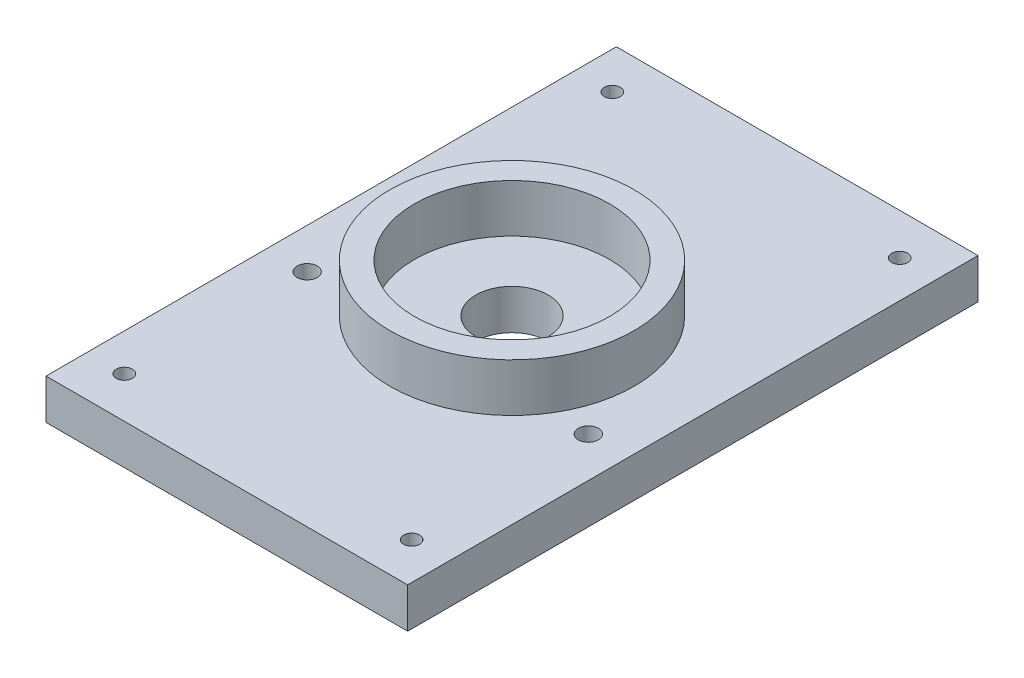
ISO-10303-21;
HEADER;
FILE_DESCRIPTION(('STEP AP214'),'2;1');
FILE_NAME('part.step','',(''),(''),'','','');
FILE_SCHEMA(('AUTOMOTIVE_DESIGN { 1 0 10303 214 1 1 1 1 }'));
ENDSEC;
DATA;
#1=APPLICATION_CONTEXT('core data for automotive mechanical design processes');
#2=APPLICATION_PROTOCOL_DEFINITION('international standard','automotive_design',2000,#1);
#3=PRODUCT_CONTEXT('',#1,'mechanical');
#4=PRODUCT('Part','Part','',(#3));
#5=PRODUCT_RELATED_PRODUCT_CATEGORY('part','',(#4));
#6=PRODUCT_DEFINITION_FORMATION('','',#4);
#7=PRODUCT_DEFINITION_CONTEXT('part definition',#1,'design');
#8=PRODUCT_DEFINITION('design','',#6,#7);
#9=PRODUCT_DEFINITION_SHAPE('','',#8);
#10=(LENGTH_UNIT() NAMED_UNIT(*) SI_UNIT(.MILLI.,.METRE.));
#11=(NAMED_UNIT(*) PLANE_ANGLE_UNIT() SI_UNIT($,.RADIAN.));
#12=(NAMED_UNIT(*) SI_UNIT($,.STERADIAN.) SOLID_ANGLE_UNIT());
#13=UNCERTAINTY_MEASURE_WITH_UNIT(LENGTH_MEASURE(1.E-05),#10,'distance_accuracy_value','');
#14=(GEOMETRIC_REPRESENTATION_CONTEXT(3) GLOBAL_UNCERTAINTY_ASSIGNED_CONTEXT((#13)) GLOBAL_UNIT_ASSIGNED_CONTEXT((#10,
#11,#12)) REPRESENTATION_CONTEXT('',''));
#15=CARTESIAN_POINT('',(0.,0.,0.));
#16=DIRECTION('',(0.,0.,1.));
#17=DIRECTION('',(1.,0.,0.));
#18=AXIS2_PLACEMENT_3D('',#15,#16,#17);
#19=CARTESIAN_POINT('',(0.,5.,0.));
#20=DIRECTION('',(0.,1.,0.));
#21=DIRECTION('',(0.,0.,1.));
#22=AXIS2_PLACEMENT_3D('',#19,#20,#21);
#23=PLANE('',#22);
#24=CARTESIAN_POINT('',(0.136395342844091,5.,-0.409186028532307));
#25=DIRECTION('',(0.,1.,0.));
#26=DIRECTION('',(0.,0.,1.));
#27=AXIS2_PLACEMENT_3D('',#24,#25,#26);
#28=CIRCLE('',#27,4.5);
#29=CARTESIAN_POINT('',(0.136395342844091,5.,4.09081397146769));
#30=VERTEX_POINT('',#29);
#31=EDGE_CURVE('E114',#30,#30,#28,.T.);
#32=ORIENTED_EDGE('',*,*,#31,.F.);
#33=EDGE_LOOP('',(#32));
#34=FACE_BOUND('',#33,.T.);
#35=CARTESIAN_POINT('',(0.136395342844091,5.,-0.409186028532307));
#36=DIRECTION('',(0.,1.,0.));
#37=DIRECTION('',(0.,0.,1.));
#38=AXIS2_PLACEMENT_3D('',#35,#36,#37);
#39=CIRCLE('',#38,12.15);
#40=CARTESIAN_POINT('',(0.136395342844091,5.,11.7408139714677));
#41=VERTEX_POINT('',#40);
#42=EDGE_CURVE('E135',#41,#41,#39,.F.);
#43=ORIENTED_EDGE('',*,*,#42,.F.);
#44=EDGE_LOOP('',(#43));
#45=FACE_BOUND('',#44,.T.);
#46=ADVANCED_FACE('F46',(#34,#45),#23,.T.);
#47=CARTESIAN_POINT('',(0.136395342844091,5.,-0.409186028532307));
#48=DIRECTION('',(0.,1.,0.));
#49=DIRECTION('',(0.,0.,1.));
#50=AXIS2_PLACEMENT_3D('',#47,#48,#49);
#51=CIRCLE('',#50,15.2);
#52=CARTESIAN_POINT('',(0.136395342844091,5.,14.7908139714677));
#53=VERTEX_POINT('',#52);
#54=EDGE_CURVE('E132',#53,#53,#51,.T.);
#55=ORIENTED_EDGE('',*,*,#54,.F.);
#56=EDGE_LOOP('',(#55));
#57=FACE_BOUND('',#56,.T.);
#58=DIRECTION('',(0.,0.,1.));
#59=VECTOR('',#58,1.);
#60=CARTESIAN_POINT('',(-22.3714650620397,5.,-35.9091860285323));
#61=LINE('',#60,#59);
#62=CARTESIAN_POINT('',(-22.3714650620397,5.,-35.9091860285323));
#63=VERTEX_POINT('',#62);
#64=CARTESIAN_POINT('',(-22.3714650620397,5.,35.0908139714677));
#65=VERTEX_POINT('',#64);
#66=EDGE_CURVE('E99',#63,#65,#61,.T.);
#67=ORIENTED_EDGE('',*,*,#66,.T.);
#68=DIRECTION('',(1.,0.,0.));
#69=VECTOR('',#68,1.);
#70=CARTESIAN_POINT('',(-22.3714650620397,5.,35.0908139714677));
#71=LINE('',#70,#69);
#72=CARTESIAN_POINT('',(22.6442557477279,5.,35.0908139714677));
#73=VERTEX_POINT('',#72);
#74=EDGE_CURVE('E93',#65,#73,#71,.T.);
#75=ORIENTED_EDGE('',*,*,#74,.T.);
#76=DIRECTION('',(0.,0.,-1.));
#77=VECTOR('',#76,1.);
#78=CARTESIAN_POINT('',(22.6442557477279,5.,35.0908139714677));
#79=LINE('',#78,#77);
#80=CARTESIAN_POINT('',(22.6442557477279,5.,-35.9091860285323));
#81=VERTEX_POINT('',#80);
#82=EDGE_CURVE('E97',#73,#81,#79,.T.);
#83=ORIENTED_EDGE('',*,*,#82,.T.);
#84=DIRECTION('',(-1.,0.,0.));
#85=VECTOR('',#84,1.);
#86=CARTESIAN_POINT('',(22.6442557477279,5.,-35.9091860285323));
#87=LINE('',#86,#85);
#88=EDGE_CURVE('E63',#81,#63,#87,.T.);
#89=ORIENTED_EDGE('',*,*,#88,.T.);
#90=EDGE_LOOP('',(#67,#75,#83,#89));
#91=FACE_BOUND('',#90,.T.);
#92=CARTESIAN_POINT('',(-17.7501447184801,5.,29.9694936279081));
#93=DIRECTION('',(0.,1.,0.));
#94=DIRECTION('',(0.,0.,1.));
#95=AXIS2_PLACEMENT_3D('',#92,#93,#94);
#96=CIRCLE('',#95,0.999999999999994);
#97=CARTESIAN_POINT('',(-17.7501447184801,5.,30.9694936279081));
#98=VERTEX_POINT('',#97);
#99=EDGE_CURVE('E146',#98,#98,#96,.T.);
#100=ORIENTED_EDGE('',*,*,#99,.F.);
#101=EDGE_LOOP('',(#100));
#102=FACE_BOUND('',#101,.T.);
#103=CARTESIAN_POINT('',(18.0229354041683,5.,29.9694936279081));
#104=DIRECTION('',(0.,1.,0.));
#105=DIRECTION('',(0.,0.,1.));
#106=AXIS2_PLACEMENT_3D('',#103,#104,#105);
#107=CIRCLE('',#106,0.999999999999994);
#108=CARTESIAN_POINT('',(18.0229354041683,5.,30.9694936279081));
#109=VERTEX_POINT('',#108);
#110=EDGE_CURVE('E152',#109,#109,#107,.T.);
#111=ORIENTED_EDGE('',*,*,#110,.F.);
#112=EDGE_LOOP('',(#111));
#113=FACE_BOUND('',#112,.T.);
#114=CARTESIAN_POINT('',(17.6363953428441,5.,7.59081397145539));
#115=DIRECTION('',(0.,1.,0.));
#116=DIRECTION('',(0.,0.,1.));
#117=AXIS2_PLACEMENT_3D('',#114,#115,#116);
#118=CIRCLE('',#117,1.25);
#119=CARTESIAN_POINT('',(17.6363953428441,5.,8.84081397145539));
#120=VERTEX_POINT('',#119);
#121=EDGE_CURVE('E158',#120,#120,#118,.T.);
#122=ORIENTED_EDGE('',*,*,#121,.F.);
#123=EDGE_LOOP('',(#122));
#124=FACE_BOUND('',#123,.T.);
#125=CARTESIAN_POINT('',(-17.3636046571559,5.,7.59081397145539));
#126=DIRECTION('',(0.,1.,0.));
#127=DIRECTION('',(0.,0.,1.));
#128=AXIS2_PLACEMENT_3D('',#125,#126,#127);
#129=CIRCLE('',#128,1.25);
#130=CARTESIAN_POINT('',(-17.3636046571559,5.,8.8408139714554));
#131=VERTEX_POINT('',#130);
#132=EDGE_CURVE('E164',#131,#131,#129,.T.);
#133=ORIENTED_EDGE('',*,*,#132,.F.);
#134=EDGE_LOOP('',(#133));
#135=FACE_BOUND('',#134,.T.);
#136=CARTESIAN_POINT('',(-17.7501447184801,5.,-30.7878656849727));
#137=DIRECTION('',(0.,1.,0.));
#138=DIRECTION('',(0.,0.,1.));
#139=AXIS2_PLACEMENT_3D('',#136,#137,#138);
#140=CIRCLE('',#139,0.999999999999998);
#141=CARTESIAN_POINT('',(-17.7501447184801,5.,-29.7878656849727));
#142=VERTEX_POINT('',#141);
#143=EDGE_CURVE('E170',#142,#142,#140,.T.);
#144=ORIENTED_EDGE('',*,*,#143,.F.);
#145=EDGE_LOOP('',(#144));
#146=FACE_BOUND('',#145,.T.);
#147=CARTESIAN_POINT('',(18.0229354041683,5.,-30.7878656849727));
#148=DIRECTION('',(0.,1.,0.));
#149=DIRECTION('',(0.,0.,1.));
#150=AXIS2_PLACEMENT_3D('',#147,#148,#149);
#151=CIRCLE('',#150,0.999999999999998);
#152=CARTESIAN_POINT('',(18.0229354041683,5.,-29.7878656849727));
#153=VERTEX_POINT('',#152);
#154=EDGE_CURVE('E176',#153,#153,#151,.T.);
#155=ORIENTED_EDGE('',*,*,#154,.F.);
#156=EDGE_LOOP('',(#155));
#157=FACE_BOUND('',#156,.T.);
#158=ADVANCED_FACE('F94',(#57,#91,#102,#113,#124,#135,#146,#157),#23,.T.);
#159=CARTESIAN_POINT('',(0.,0.,0.));
#160=DIRECTION('',(0.,1.,0.));
#161=DIRECTION('',(0.,0.,1.));
#162=AXIS2_PLACEMENT_3D('',#159,#160,#161);
#163=PLANE('',#162);
#164=DIRECTION('',(0.,0.,1.));
#165=VECTOR('',#164,1.);
#166=CARTESIAN_POINT('',(-22.3714650620397,0.,-35.9091860285323));
#167=LINE('',#166,#165);
#168=CARTESIAN_POINT('',(-22.3714650620397,0.,-35.9091860285323));
#169=VERTEX_POINT('',#168);
#170=CARTESIAN_POINT('',(-22.3714650620397,0.,35.0908139714677));
#171=VERTEX_POINT('',#170);
#172=EDGE_CURVE('E111',#169,#171,#167,.T.);
#173=ORIENTED_EDGE('',*,*,#172,.F.);
#174=DIRECTION('',(-1.,0.,0.));
#175=VECTOR('',#174,1.);
#176=CARTESIAN_POINT('',(22.6442557477279,0.,-35.9091860285323));
#177=LINE('',#176,#175);
#178=CARTESIAN_POINT('',(22.6442557477279,0.,-35.9091860285323));
#179=VERTEX_POINT('',#178);
#180=EDGE_CURVE('E86',#179,#169,#177,.T.);
#181=ORIENTED_EDGE('',*,*,#180,.F.);
#182=DIRECTION('',(0.,0.,-1.));
#183=VECTOR('',#182,1.);
#184=CARTESIAN_POINT('',(22.6442557477279,0.,35.0908139714677));
#185=LINE('',#184,#183);
#186=CARTESIAN_POINT('',(22.6442557477279,0.,35.0908139714677));
#187=VERTEX_POINT('',#186);
#188=EDGE_CURVE('E80',#187,#179,#185,.T.);
#189=ORIENTED_EDGE('',*,*,#188,.F.);
#190=DIRECTION('',(1.,0.,0.));
#191=VECTOR('',#190,1.);
#192=CARTESIAN_POINT('',(-22.3714650620397,0.,35.0908139714677));
#193=LINE('',#192,#191);
#194=EDGE_CURVE('E103',#171,#187,#193,.T.);
#195=ORIENTED_EDGE('',*,*,#194,.F.);
#196=EDGE_LOOP('',(#173,#181,#189,#195));
#197=FACE_BOUND('',#196,.T.);
#198=CARTESIAN_POINT('',(0.136395342844091,0.,-0.409186028532307));
#199=DIRECTION('',(0.,1.,0.));
#200=DIRECTION('',(0.,0.,1.));
#201=AXIS2_PLACEMENT_3D('',#198,#199,#200);
#202=CIRCLE('',#201,4.5);
#203=CARTESIAN_POINT('',(0.136395342844091,0.,4.09081397146769));
#204=VERTEX_POINT('',#203);
#205=EDGE_CURVE('E126',#204,#204,#202,.T.);
#206=ORIENTED_EDGE('',*,*,#205,.T.);
#207=EDGE_LOOP('',(#206));
#208=FACE_BOUND('',#207,.T.);
#209=CARTESIAN_POINT('',(-17.7501447184801,0.,29.9694936279081));
#210=DIRECTION('',(0.,1.,0.));
#211=DIRECTION('',(0.,0.,1.));
#212=AXIS2_PLACEMENT_3D('',#209,#210,#211);
#213=CIRCLE('',#212,0.999999999999994);
#214=CARTESIAN_POINT('',(-17.7501447184801,0.,30.9694936279081));
#215=VERTEX_POINT('',#214);
#216=EDGE_CURVE('E141',#215,#215,#213,.F.);
#217=ORIENTED_EDGE('',*,*,#216,.F.);
#218=EDGE_LOOP('',(#217));
#219=FACE_BOUND('',#218,.T.);
#220=CARTESIAN_POINT('',(18.0229354041683,0.,29.9694936279081));
#221=DIRECTION('',(0.,1.,0.));
#222=DIRECTION('',(0.,0.,1.));
#223=AXIS2_PLACEMENT_3D('',#220,#221,#222);
#224=CIRCLE('',#223,0.999999999999994);
#225=CARTESIAN_POINT('',(18.0229354041683,0.,30.9694936279081));
#226=VERTEX_POINT('',#225);
#227=EDGE_CURVE('E149',#226,#226,#224,.F.);
#228=ORIENTED_EDGE('',*,*,#227,.F.);
#229=EDGE_LOOP('',(#228));
#230=FACE_BOUND('',#229,.T.);
#231=CARTESIAN_POINT('',(17.6363953428441,0.,7.59081397145539));
#232=DIRECTION('',(0.,1.,0.));
#233=DIRECTION('',(0.,0.,1.));
#234=AXIS2_PLACEMENT_3D('',#231,#232,#233);
#235=CIRCLE('',#234,1.25);
#236=CARTESIAN_POINT('',(17.6363953428441,0.,8.84081397145539));
#237=VERTEX_POINT('',#236);
#238=EDGE_CURVE('E155',#237,#237,#235,.F.);
#239=ORIENTED_EDGE('',*,*,#238,.F.);
#240=EDGE_LOOP('',(#239));
#241=FACE_BOUND('',#240,.T.);
#242=CARTESIAN_POINT('',(-17.3636046571559,0.,7.59081397145539));
#243=DIRECTION('',(0.,1.,0.));
#244=DIRECTION('',(0.,0.,1.));
#245=AXIS2_PLACEMENT_3D('',#242,#243,#244);
#246=CIRCLE('',#245,1.25);
#247=CARTESIAN_POINT('',(-17.3636046571559,0.,8.8408139714554));
#248=VERTEX_POINT('',#247);
#249=EDGE_CURVE('E161',#248,#248,#246,.F.);
#250=ORIENTED_EDGE('',*,*,#249,.F.);
#251=EDGE_LOOP('',(#250));
#252=FACE_BOUND('',#251,.T.);
#253=CARTESIAN_POINT('',(-17.7501447184801,0.,-30.7878656849727));
#254=DIRECTION('',(0.,1.,0.));
#255=DIRECTION('',(0.,0.,1.));
#256=AXIS2_PLACEMENT_3D('',#253,#254,#255);
#257=CIRCLE('',#256,0.999999999999998);
#258=CARTESIAN_POINT('',(-17.7501447184801,0.,-29.7878656849727));
#259=VERTEX_POINT('',#258);
#260=EDGE_CURVE('E167',#259,#259,#257,.F.);
#261=ORIENTED_EDGE('',*,*,#260,.F.);
#262=EDGE_LOOP('',(#261));
#263=FACE_BOUND('',#262,.T.);
#264=CARTESIAN_POINT('',(18.0229354041683,0.,-30.7878656849727));
#265=DIRECTION('',(0.,1.,0.));
#266=DIRECTION('',(0.,0.,1.));
#267=AXIS2_PLACEMENT_3D('',#264,#265,#266);
#268=CIRCLE('',#267,0.999999999999998);
#269=CARTESIAN_POINT('',(18.0229354041683,0.,-29.7878656849727));
#270=VERTEX_POINT('',#269);
#271=EDGE_CURVE('E173',#270,#270,#268,.F.);
#272=ORIENTED_EDGE('',*,*,#271,.F.);
#273=EDGE_LOOP('',(#272));
#274=FACE_BOUND('',#273,.T.);
#275=ADVANCED_FACE('F122',(#197,#208,#219,#230,#241,#252,#263,#274),#163,.F.);
#276=CARTESIAN_POINT('',(-22.3714650620397,5.,-35.9091860285323));
#277=DIRECTION('',(1.,0.,0.));
#278=DIRECTION('',(0.,0.,-1.));
#279=AXIS2_PLACEMENT_3D('',#276,#277,#278);
#280=PLANE('',#279);
#281=ORIENTED_EDGE('',*,*,#172,.T.);
#282=DIRECTION('',(0.,-1.,0.));
#283=VECTOR('',#282,1.);
#284=CARTESIAN_POINT('',(-22.3714650620397,5.,35.0908139714677));
#285=LINE('',#284,#283);
#286=EDGE_CURVE('E11',#65,#171,#285,.T.);
#287=ORIENTED_EDGE('',*,*,#286,.F.);
#288=ORIENTED_EDGE('',*,*,#66,.F.);
#289=DIRECTION('',(0.,-1.,0.));
#290=VECTOR('',#289,1.);
#291=CARTESIAN_POINT('',(-22.3714650620397,5.,-35.9091860285323));
#292=LINE('',#291,#290);
#293=EDGE_CURVE('E107',#63,#169,#292,.T.);
#294=ORIENTED_EDGE('',*,*,#293,.T.);
#295=EDGE_LOOP('',(#281,#287,#288,#294));
#296=FACE_BOUND('',#295,.T.);
#297=ADVANCED_FACE('F48',(#296),#280,.F.);
#298=CARTESIAN_POINT('',(-22.3714650620397,5.,35.0908139714677));
#299=DIRECTION('',(0.,0.,-1.));
#300=DIRECTION('',(-1.,0.,0.));
#301=AXIS2_PLACEMENT_3D('',#298,#299,#300);
#302=PLANE('',#301);
#303=ORIENTED_EDGE('',*,*,#194,.T.);
#304=DIRECTION('',(0.,-1.,0.));
#305=VECTOR('',#304,1.);
#306=CARTESIAN_POINT('',(22.6442557477279,5.,35.0908139714677));
#307=LINE('',#306,#305);
#308=EDGE_CURVE('E55',#73,#187,#307,.T.);
#309=ORIENTED_EDGE('',*,*,#308,.F.);
#310=ORIENTED_EDGE('',*,*,#74,.F.);
#311=ORIENTED_EDGE('',*,*,#286,.T.);
#312=EDGE_LOOP('',(#303,#309,#310,#311));
#313=FACE_BOUND('',#312,.T.);
#314=ADVANCED_FACE('F102',(#313),#302,.F.);
#315=CARTESIAN_POINT('',(22.6442557477279,5.,35.0908139714677));
#316=DIRECTION('',(-1.,0.,0.));
#317=DIRECTION('',(0.,0.,1.));
#318=AXIS2_PLACEMENT_3D('',#315,#316,#317);
#319=PLANE('',#318);
#320=ORIENTED_EDGE('',*,*,#188,.T.);
#321=DIRECTION('',(0.,-1.,0.));
#322=VECTOR('',#321,1.);
#323=CARTESIAN_POINT('',(22.6442557477279,5.,-35.9091860285323));
#324=LINE('',#323,#322);
#325=EDGE_CURVE('E104',#81,#179,#324,.T.);
#326=ORIENTED_EDGE('',*,*,#325,.F.);
#327=ORIENTED_EDGE('',*,*,#82,.F.);
#328=ORIENTED_EDGE('',*,*,#308,.T.);
#329=EDGE_LOOP('',(#320,#326,#327,#328));
#330=FACE_BOUND('',#329,.T.);
#331=ADVANCED_FACE('F105',(#330),#319,.F.);
#332=CARTESIAN_POINT('',(22.6442557477279,5.,-35.9091860285323));
#333=DIRECTION('',(0.,0.,1.));
#334=DIRECTION('',(1.,0.,0.));
#335=AXIS2_PLACEMENT_3D('',#332,#333,#334);
#336=PLANE('',#335);
#337=ORIENTED_EDGE('',*,*,#180,.T.);
#338=ORIENTED_EDGE('',*,*,#293,.F.);
#339=ORIENTED_EDGE('',*,*,#88,.F.);
#340=ORIENTED_EDGE('',*,*,#325,.T.);
#341=EDGE_LOOP('',(#337,#338,#339,#340));
#342=FACE_BOUND('',#341,.T.);
#343=ADVANCED_FACE('F119',(#342),#336,.F.);
#344=CARTESIAN_POINT('',(0.136395342844091,5.,-0.409186028532307));
#345=DIRECTION('',(0.,-1.,0.));
#346=DIRECTION('',(0.,0.,-1.));
#347=AXIS2_PLACEMENT_3D('',#344,#345,#346);
#348=CYLINDRICAL_SURFACE('',#347,4.5);
#349=ORIENTED_EDGE('',*,*,#31,.T.);
#350=EDGE_LOOP('',(#349));
#351=FACE_BOUND('',#350,.T.);
#352=ORIENTED_EDGE('',*,*,#205,.F.);
#353=EDGE_LOOP('',(#352));
#354=FACE_BOUND('',#353,.T.);
#355=ADVANCED_FACE('F193',(#351,#354),#348,.F.);
#356=CARTESIAN_POINT('',(0.136395342844091,11.,-0.409186028532307));
#357=DIRECTION('',(0.,1.,0.));
#358=DIRECTION('',(0.,0.,1.));
#359=AXIS2_PLACEMENT_3D('',#356,#357,#358);
#360=PLANE('',#359);
#361=CARTESIAN_POINT('',(0.136395342844091,11.,-0.409186028532307));
#362=DIRECTION('',(0.,1.,0.));
#363=DIRECTION('',(0.,0.,1.));
#364=AXIS2_PLACEMENT_3D('',#361,#362,#363);
#365=CIRCLE('',#364,15.2);
#366=CARTESIAN_POINT('',(0.136395342844091,11.,14.7908139714677));
#367=VERTEX_POINT('',#366);
#368=EDGE_CURVE('E129',#367,#367,#365,.T.);
#369=ORIENTED_EDGE('',*,*,#368,.T.);
#370=EDGE_LOOP('',(#369));
#371=FACE_BOUND('',#370,.T.);
#372=CARTESIAN_POINT('',(0.136395342844091,11.,-0.409186028532307));
#373=DIRECTION('',(0.,1.,0.));
#374=DIRECTION('',(0.,0.,1.));
#375=AXIS2_PLACEMENT_3D('',#372,#373,#374);
#376=CIRCLE('',#375,12.15);
#377=CARTESIAN_POINT('',(0.136395342844091,11.,11.7408139714677));
#378=VERTEX_POINT('',#377);
#379=EDGE_CURVE('E138',#378,#378,#376,.T.);
#380=ORIENTED_EDGE('',*,*,#379,.F.);
#381=EDGE_LOOP('',(#380));
#382=FACE_BOUND('',#381,.T.);
#383=ADVANCED_FACE('F235',(#371,#382),#360,.T.);
#384=CARTESIAN_POINT('',(0.136395342844091,11.,-0.409186028532307));
#385=DIRECTION('',(0.,-1.,0.));
#386=DIRECTION('',(0.,0.,-1.));
#387=AXIS2_PLACEMENT_3D('',#384,#385,#386);
#388=CYLINDRICAL_SURFACE('',#387,15.2);
#389=ORIENTED_EDGE('',*,*,#368,.F.);
#390=EDGE_LOOP('',(#389));
#391=FACE_BOUND('',#390,.T.);
#392=ORIENTED_EDGE('',*,*,#54,.T.);
#393=EDGE_LOOP('',(#392));
#394=FACE_BOUND('',#393,.T.);
#395=ADVANCED_FACE('F231',(#391,#394),#388,.T.);
#396=CARTESIAN_POINT('',(0.136395342844091,-29.5068109219035,-0.409186028532307));
#397=DIRECTION('',(0.,1.,0.));
#398=DIRECTION('',(0.,0.,1.));
#399=AXIS2_PLACEMENT_3D('',#396,#397,#398);
#400=CYLINDRICAL_SURFACE('',#399,12.15);
#401=ORIENTED_EDGE('',*,*,#42,.T.);
#402=EDGE_LOOP('',(#401));
#403=FACE_BOUND('',#402,.T.);
#404=ORIENTED_EDGE('',*,*,#379,.T.);
#405=EDGE_LOOP('',(#404));
#406=FACE_BOUND('',#405,.T.);
#407=ADVANCED_FACE('F247',(#403,#406),#400,.F.);
#408=CARTESIAN_POINT('',(-17.7501447184801,-4.94974746830584,29.9694936279081));
#409=DIRECTION('',(0.,1.,0.));
#410=DIRECTION('',(0.,0.,1.));
#411=AXIS2_PLACEMENT_3D('',#408,#409,#410);
#412=CYLINDRICAL_SURFACE('',#411,0.999999999999994);
#413=ORIENTED_EDGE('',*,*,#216,.T.);
#414=EDGE_LOOP('',(#413));
#415=FACE_BOUND('',#414,.T.);
#416=ORIENTED_EDGE('',*,*,#99,.T.);
#417=EDGE_LOOP('',(#416));
#418=FACE_BOUND('',#417,.T.);
#419=ADVANCED_FACE('F251',(#415,#418),#412,.F.);
#420=CARTESIAN_POINT('',(18.0229354041683,-4.94974746830584,29.9694936279081));
#421=DIRECTION('',(0.,1.,0.));
#422=DIRECTION('',(0.,0.,1.));
#423=AXIS2_PLACEMENT_3D('',#420,#421,#422);
#424=CYLINDRICAL_SURFACE('',#423,0.999999999999994);
#425=ORIENTED_EDGE('',*,*,#227,.T.);
#426=EDGE_LOOP('',(#425));
#427=FACE_BOUND('',#426,.T.);
#428=ORIENTED_EDGE('',*,*,#110,.T.);
#429=EDGE_LOOP('',(#428));
#430=FACE_BOUND('',#429,.T.);
#431=ADVANCED_FACE('F265',(#427,#430),#424,.F.);
#432=CARTESIAN_POINT('',(17.6363953428441,-4.94974746830584,7.59081397145539));
#433=DIRECTION('',(0.,1.,0.));
#434=DIRECTION('',(0.,0.,1.));
#435=AXIS2_PLACEMENT_3D('',#432,#433,#434);
#436=CYLINDRICAL_SURFACE('',#435,1.25);
#437=ORIENTED_EDGE('',*,*,#238,.T.);
#438=EDGE_LOOP('',(#437));
#439=FACE_BOUND('',#438,.T.);
#440=ORIENTED_EDGE('',*,*,#121,.T.);
#441=EDGE_LOOP('',(#440));
#442=FACE_BOUND('',#441,.T.);
#443=ADVANCED_FACE('F275',(#439,#442),#436,.F.);
#444=CARTESIAN_POINT('',(-17.3636046571559,-4.94974746830584,7.59081397145539));
#445=DIRECTION('',(0.,1.,0.));
#446=DIRECTION('',(0.,0.,1.));
#447=AXIS2_PLACEMENT_3D('',#444,#445,#446);
#448=CYLINDRICAL_SURFACE('',#447,1.25);
#449=ORIENTED_EDGE('',*,*,#249,.T.);
#450=EDGE_LOOP('',(#449));
#451=FACE_BOUND('',#450,.T.);
#452=ORIENTED_EDGE('',*,*,#132,.T.);
#453=EDGE_LOOP('',(#452));
#454=FACE_BOUND('',#453,.T.);
#455=ADVANCED_FACE('F285',(#451,#454),#448,.F.);
#456=CARTESIAN_POINT('',(-17.7501447184801,-4.94974746830584,-30.7878656849727));
#457=DIRECTION('',(0.,1.,0.));
#458=DIRECTION('',(0.,0.,1.));
#459=AXIS2_PLACEMENT_3D('',#456,#457,#458);
#460=CYLINDRICAL_SURFACE('',#459,0.999999999999998);
#461=ORIENTED_EDGE('',*,*,#260,.T.);
#462=EDGE_LOOP('',(#461));
#463=FACE_BOUND('',#462,.T.);
#464=ORIENTED_EDGE('',*,*,#143,.T.);
#465=EDGE_LOOP('',(#464));
#466=FACE_BOUND('',#465,.T.);
#467=ADVANCED_FACE('F295',(#463,#466),#460,.F.);
#468=CARTESIAN_POINT('',(18.0229354041683,-4.94974746830584,-30.7878656849727));
#469=DIRECTION('',(0.,1.,0.));
#470=DIRECTION('',(0.,0.,1.));
#471=AXIS2_PLACEMENT_3D('',#468,#469,#470);
#472=CYLINDRICAL_SURFACE('',#471,0.999999999999998);
#473=ORIENTED_EDGE('',*,*,#271,.T.);
#474=EDGE_LOOP('',(#473));
#475=FACE_BOUND('',#474,.T.);
#476=ORIENTED_EDGE('',*,*,#154,.T.);
#477=EDGE_LOOP('',(#476));
#478=FACE_BOUND('',#477,.T.);
#479=ADVANCED_FACE('F180',(#475,#478),#472,.F.);
#480=CLOSED_SHELL('',(#46,#158,#275,#297,#314,#331,#343,#355,#383,#395,#407,#419,#431,#443,#455,
#467,#479));
#481=MANIFOLD_SOLID_BREP('B2',#480);
#482=ADVANCED_BREP_SHAPE_REPRESENTATION('',(#18,#481),#14);
#483=SHAPE_DEFINITION_REPRESENTATION(#9,#482);
ENDSEC;
END-ISO-10303-21;
